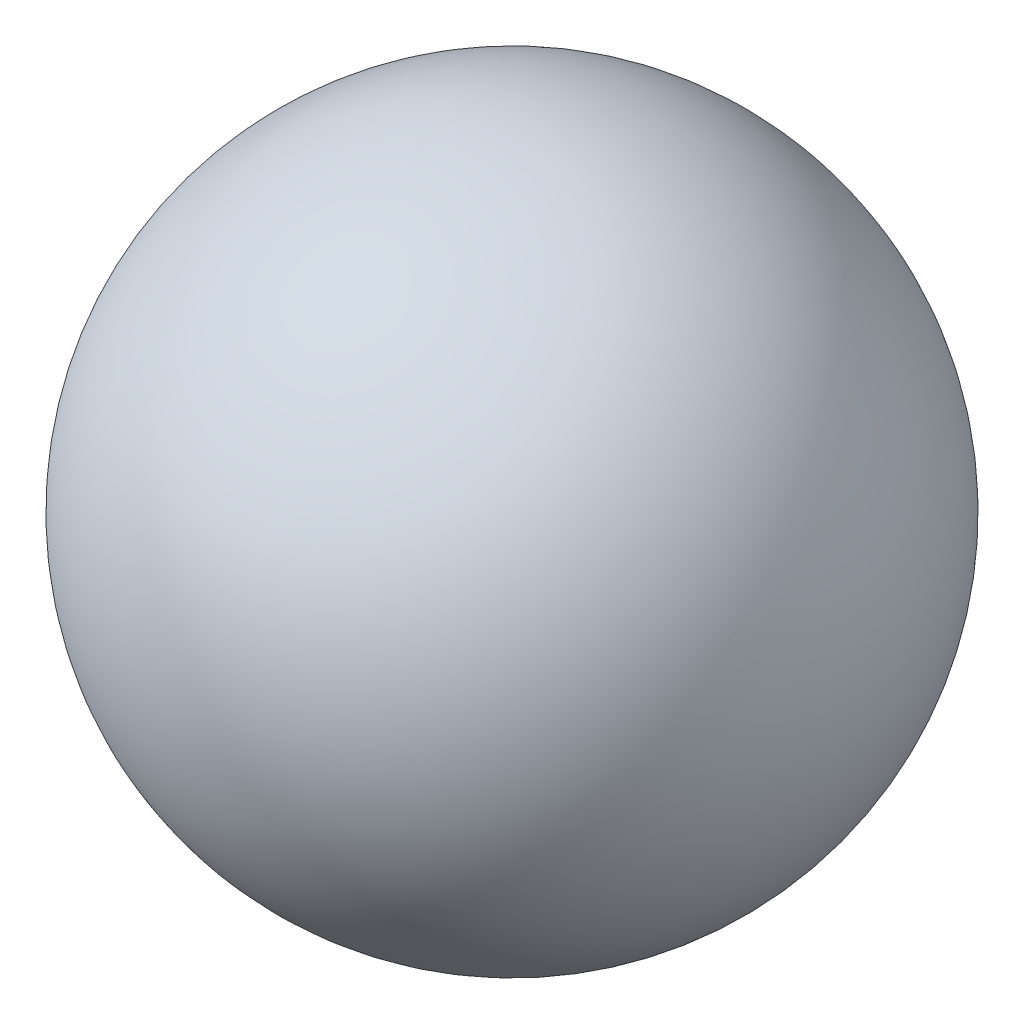
ISO-10303-21;
HEADER;
FILE_DESCRIPTION(('STEP AP214'),'2;1');
FILE_NAME('part.step','',(''),(''),'','','');
FILE_SCHEMA(('AUTOMOTIVE_DESIGN { 1 0 10303 214 1 1 1 1 }'));
ENDSEC;
DATA;
#1=APPLICATION_CONTEXT('core data for automotive mechanical design processes');
#2=APPLICATION_PROTOCOL_DEFINITION('international standard','automotive_design',2000,#1);
#3=PRODUCT_CONTEXT('',#1,'mechanical');
#4=PRODUCT('Part','Part','',(#3));
#5=PRODUCT_RELATED_PRODUCT_CATEGORY('part','',(#4));
#6=PRODUCT_DEFINITION_FORMATION('','',#4);
#7=PRODUCT_DEFINITION_CONTEXT('part definition',#1,'design');
#8=PRODUCT_DEFINITION('design','',#6,#7);
#9=PRODUCT_DEFINITION_SHAPE('','',#8);
#10=(LENGTH_UNIT() NAMED_UNIT(*) SI_UNIT(.MILLI.,.METRE.));
#11=(NAMED_UNIT(*) PLANE_ANGLE_UNIT() SI_UNIT($,.RADIAN.));
#12=(NAMED_UNIT(*) SI_UNIT($,.STERADIAN.) SOLID_ANGLE_UNIT());
#13=UNCERTAINTY_MEASURE_WITH_UNIT(LENGTH_MEASURE(1.E-05),#10,'distance_accuracy_value','');
#14=(GEOMETRIC_REPRESENTATION_CONTEXT(3) GLOBAL_UNCERTAINTY_ASSIGNED_CONTEXT((#13)) GLOBAL_UNIT_ASSIGNED_CONTEXT((#10,
#11,#12)) REPRESENTATION_CONTEXT('',''));
#15=CARTESIAN_POINT('',(0.,0.,0.));
#16=DIRECTION('',(0.,0.,1.));
#17=DIRECTION('',(1.,0.,0.));
#18=AXIS2_PLACEMENT_3D('',#15,#16,#17);
#19=CARTESIAN_POINT('',(49.75,14.7439006959592,-50.9074099961655));
#20=DIRECTION('',(0.,0.27818943001272,-0.960526231307192));
#21=DIRECTION('',(0.173648177666934,0.94593367956292,0.273963107482574));
#22=AXIS2_PLACEMENT_3D('',#19,#20,#21);
#23=SPHERICAL_SURFACE('',#22,5.95);
#24=CARTESIAN_POINT('',(49.75,13.0886735873835,-45.1922789198877));
#25=VERTEX_POINT('',#24);
#26=VERTEX_LOOP('',#25);
#27=FACE_BOUND('',#26,.T.);
#28=CARTESIAN_POINT('',(49.75,16.3991278045349,-56.6225410724433));
#29=VERTEX_POINT('',#28);
#30=VERTEX_LOOP('',#29);
#31=FACE_BOUND('',#30,.T.);
#32=ADVANCED_FACE('F16',(#27,#31),#23,.T.);
#33=CLOSED_SHELL('',(#32));
#34=MANIFOLD_SOLID_BREP('B1',#33);
#35=ADVANCED_BREP_SHAPE_REPRESENTATION('',(#18,#34),#14);
#36=SHAPE_DEFINITION_REPRESENTATION(#9,#35);
ENDSEC;
END-ISO-10303-21;
